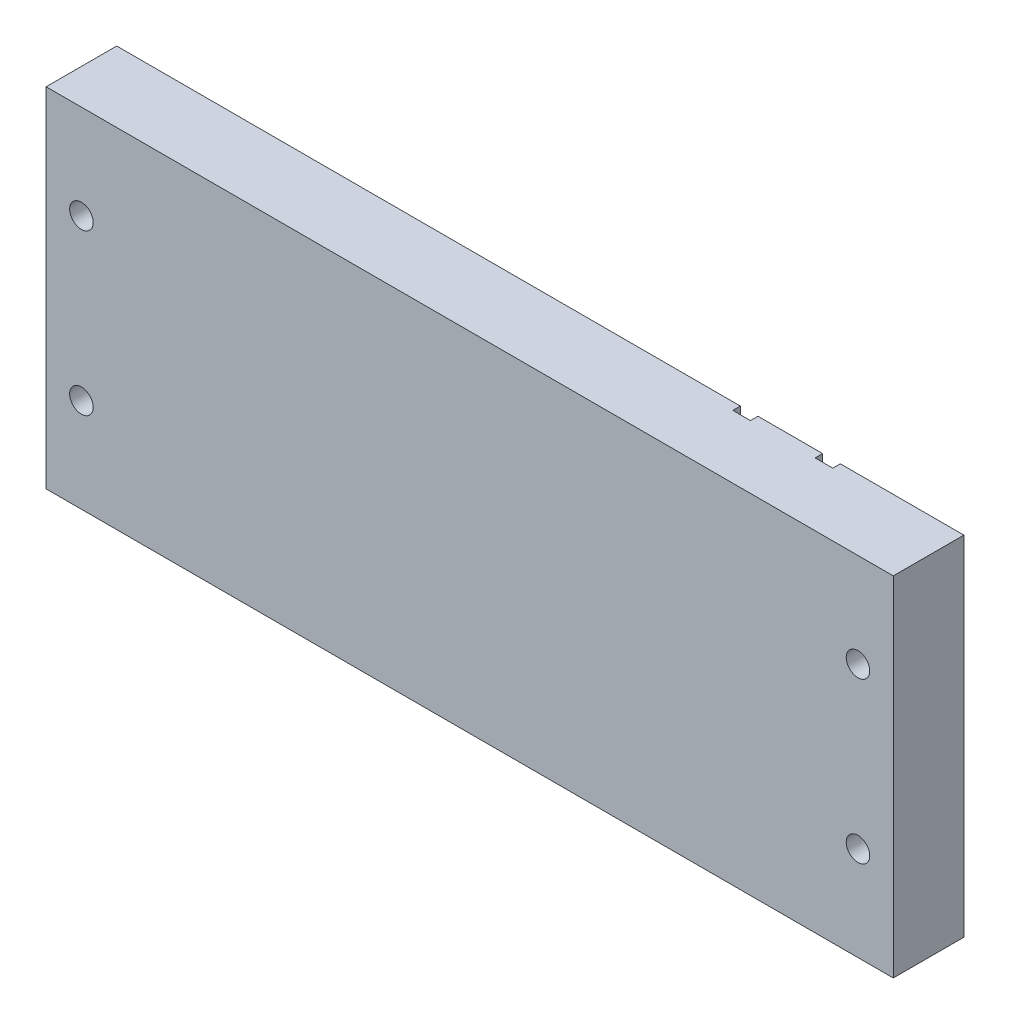
ISO-10303-21;
HEADER;
FILE_DESCRIPTION(('STEP AP214'),'2;1');
FILE_NAME('part.step','',(''),(''),'','','');
FILE_SCHEMA(('AUTOMOTIVE_DESIGN { 1 0 10303 214 1 1 1 1 }'));
ENDSEC;
DATA;
#1=APPLICATION_CONTEXT('core data for automotive mechanical design processes');
#2=APPLICATION_PROTOCOL_DEFINITION('international standard','automotive_design',2000,#1);
#3=PRODUCT_CONTEXT('',#1,'mechanical');
#4=PRODUCT('Part','Part','',(#3));
#5=PRODUCT_RELATED_PRODUCT_CATEGORY('part','',(#4));
#6=PRODUCT_DEFINITION_FORMATION('','',#4);
#7=PRODUCT_DEFINITION_CONTEXT('part definition',#1,'design');
#8=PRODUCT_DEFINITION('design','',#6,#7);
#9=PRODUCT_DEFINITION_SHAPE('','',#8);
#10=(LENGTH_UNIT() NAMED_UNIT(*) SI_UNIT(.MILLI.,.METRE.));
#11=(NAMED_UNIT(*) PLANE_ANGLE_UNIT() SI_UNIT($,.RADIAN.));
#12=(NAMED_UNIT(*) SI_UNIT($,.STERADIAN.) SOLID_ANGLE_UNIT());
#13=UNCERTAINTY_MEASURE_WITH_UNIT(LENGTH_MEASURE(1.E-05),#10,'distance_accuracy_value','');
#14=(GEOMETRIC_REPRESENTATION_CONTEXT(3) GLOBAL_UNCERTAINTY_ASSIGNED_CONTEXT((#13)) GLOBAL_UNIT_ASSIGNED_CONTEXT((#10,
#11,#12)) REPRESENTATION_CONTEXT('',''));
#15=CARTESIAN_POINT('',(0.,0.,0.));
#16=DIRECTION('',(0.,0.,1.));
#17=DIRECTION('',(1.,0.,0.));
#18=AXIS2_PLACEMENT_3D('',#15,#16,#17);
#19=CARTESIAN_POINT('',(-220.938462115417,46.9900000000002,0.));
#20=DIRECTION('',(0.,1.,0.));
#21=DIRECTION('',(0.,0.,1.));
#22=AXIS2_PLACEMENT_3D('',#19,#20,#21);
#23=PLANE('',#22);
#24=DIRECTION('',(0.,0.,1.));
#25=VECTOR('',#24,1.);
#26=CARTESIAN_POINT('',(-158.75,46.99,-9.525));
#27=LINE('',#26,#25);
#28=CARTESIAN_POINT('',(-158.75,46.99,-9.525));
#29=VERTEX_POINT('',#28);
#30=CARTESIAN_POINT('',(-158.75,46.99,9.525));
#31=VERTEX_POINT('',#30);
#32=EDGE_CURVE('E63',#29,#31,#27,.T.);
#33=ORIENTED_EDGE('',*,*,#32,.T.);
#34=DIRECTION('',(1.,0.,0.));
#35=VECTOR('',#34,1.);
#36=CARTESIAN_POINT('',(-158.75,46.99,9.52500000000001));
#37=LINE('',#36,#35);
#38=CARTESIAN_POINT('',(69.85,46.99,9.525));
#39=VERTEX_POINT('',#38);
#40=EDGE_CURVE('E42',#31,#39,#37,.T.);
#41=ORIENTED_EDGE('',*,*,#40,.T.);
#42=DIRECTION('',(0.,0.,-1.));
#43=VECTOR('',#42,1.);
#44=CARTESIAN_POINT('',(69.85,46.99,-9.525));
#45=LINE('',#44,#43);
#46=CARTESIAN_POINT('',(69.85,46.99,-9.525));
#47=VERTEX_POINT('',#46);
#48=EDGE_CURVE('E150',#39,#47,#45,.T.);
#49=ORIENTED_EDGE('',*,*,#48,.T.);
#50=DIRECTION('',(-1.,0.,0.));
#51=VECTOR('',#50,1.);
#52=CARTESIAN_POINT('',(69.85,46.99,-9.525));
#53=LINE('',#52,#51);
#54=CARTESIAN_POINT('',(36.5125,46.99,-9.525));
#55=VERTEX_POINT('',#54);
#56=EDGE_CURVE('E187',#47,#55,#53,.T.);
#57=ORIENTED_EDGE('',*,*,#56,.T.);
#58=DIRECTION('',(0.,0.,1.));
#59=VECTOR('',#58,1.);
#60=CARTESIAN_POINT('',(36.5125,46.99,-9.525));
#61=LINE('',#60,#59);
#62=CARTESIAN_POINT('',(36.5125,46.99,-7.49299999999999));
#63=VERTEX_POINT('',#62);
#64=EDGE_CURVE('E200',#55,#63,#61,.T.);
#65=ORIENTED_EDGE('',*,*,#64,.T.);
#66=DIRECTION('',(-1.,0.,0.));
#67=VECTOR('',#66,1.);
#68=CARTESIAN_POINT('',(36.5125,46.99,-7.49299999999999));
#69=LINE('',#68,#67);
#70=CARTESIAN_POINT('',(31.75,46.99,-7.49299999999999));
#71=VERTEX_POINT('',#70);
#72=EDGE_CURVE('E214',#63,#71,#69,.T.);
#73=ORIENTED_EDGE('',*,*,#72,.T.);
#74=DIRECTION('',(0.,0.,-1.));
#75=VECTOR('',#74,1.);
#76=CARTESIAN_POINT('',(31.75,46.99,-9.525));
#77=LINE('',#76,#75);
#78=CARTESIAN_POINT('',(31.75,46.99,-9.525));
#79=VERTEX_POINT('',#78);
#80=EDGE_CURVE('E228',#71,#79,#77,.T.);
#81=ORIENTED_EDGE('',*,*,#80,.T.);
#82=DIRECTION('',(-1.,0.,0.));
#83=VECTOR('',#82,1.);
#84=CARTESIAN_POINT('',(31.75,46.99,-9.525));
#85=LINE('',#84,#83);
#86=CARTESIAN_POINT('',(14.2875,46.99,-9.525));
#87=VERTEX_POINT('',#86);
#88=EDGE_CURVE('E242',#79,#87,#85,.T.);
#89=ORIENTED_EDGE('',*,*,#88,.T.);
#90=DIRECTION('',(0.,0.,1.));
#91=VECTOR('',#90,1.);
#92=CARTESIAN_POINT('',(14.2875,46.99,-9.525));
#93=LINE('',#92,#91);
#94=CARTESIAN_POINT('',(14.2875,46.99,-7.49299999999999));
#95=VERTEX_POINT('',#94);
#96=EDGE_CURVE('E256',#87,#95,#93,.T.);
#97=ORIENTED_EDGE('',*,*,#96,.T.);
#98=DIRECTION('',(-1.,0.,0.));
#99=VECTOR('',#98,1.);
#100=CARTESIAN_POINT('',(9.525,46.99,-7.49299999999999));
#101=LINE('',#100,#99);
#102=CARTESIAN_POINT('',(9.525,46.99,-7.49299999999999));
#103=VERTEX_POINT('',#102);
#104=EDGE_CURVE('E81',#95,#103,#101,.T.);
#105=ORIENTED_EDGE('',*,*,#104,.T.);
#106=DIRECTION('',(0.,0.,-1.));
#107=VECTOR('',#106,1.);
#108=CARTESIAN_POINT('',(9.525,46.99,-9.525));
#109=LINE('',#108,#107);
#110=CARTESIAN_POINT('',(9.525,46.99,-9.525));
#111=VERTEX_POINT('',#110);
#112=EDGE_CURVE('E75',#103,#111,#109,.T.);
#113=ORIENTED_EDGE('',*,*,#112,.T.);
#114=DIRECTION('',(-1.,0.,0.));
#115=VECTOR('',#114,1.);
#116=CARTESIAN_POINT('',(-158.75,46.99,-9.525));
#117=LINE('',#116,#115);
#118=EDGE_CURVE('E70',#111,#29,#117,.T.);
#119=ORIENTED_EDGE('',*,*,#118,.T.);
#120=EDGE_LOOP('',(#33,#41,#49,#57,#65,#73,#81,#89,#97,#105,#113,#119));
#121=FACE_BOUND('',#120,.T.);
#122=ADVANCED_FACE('F33',(#121),#23,.T.);
#123=CARTESIAN_POINT('',(-220.938462115417,-46.9899999999998,0.));
#124=DIRECTION('',(0.,1.,0.));
#125=DIRECTION('',(0.,0.,1.));
#126=AXIS2_PLACEMENT_3D('',#123,#124,#125);
#127=PLANE('',#126);
#128=DIRECTION('',(0.,0.,1.));
#129=VECTOR('',#128,1.);
#130=CARTESIAN_POINT('',(-158.75,-46.99,-9.525));
#131=LINE('',#130,#129);
#132=CARTESIAN_POINT('',(-158.75,-46.99,-9.525));
#133=VERTEX_POINT('',#132);
#134=CARTESIAN_POINT('',(-158.75,-46.99,9.525));
#135=VERTEX_POINT('',#134);
#136=EDGE_CURVE('E158',#133,#135,#131,.T.);
#137=ORIENTED_EDGE('',*,*,#136,.F.);
#138=DIRECTION('',(-1.,0.,0.));
#139=VECTOR('',#138,1.);
#140=CARTESIAN_POINT('',(-158.75,-46.99,-9.525));
#141=LINE('',#140,#139);
#142=CARTESIAN_POINT('',(9.525,-46.99,-9.525));
#143=VERTEX_POINT('',#142);
#144=EDGE_CURVE('E90',#143,#133,#141,.T.);
#145=ORIENTED_EDGE('',*,*,#144,.F.);
#146=DIRECTION('',(0.,0.,-1.));
#147=VECTOR('',#146,1.);
#148=CARTESIAN_POINT('',(9.525,-46.99,-9.525));
#149=LINE('',#148,#147);
#150=CARTESIAN_POINT('',(9.525,-46.99,-7.49299999999999));
#151=VERTEX_POINT('',#150);
#152=EDGE_CURVE('E95',#151,#143,#149,.T.);
#153=ORIENTED_EDGE('',*,*,#152,.F.);
#154=DIRECTION('',(-1.,0.,0.));
#155=VECTOR('',#154,1.);
#156=CARTESIAN_POINT('',(9.525,-46.99,-7.49299999999999));
#157=LINE('',#156,#155);
#158=CARTESIAN_POINT('',(14.2875,-46.99,-7.49299999999999));
#159=VERTEX_POINT('',#158);
#160=EDGE_CURVE('E101',#159,#151,#157,.T.);
#161=ORIENTED_EDGE('',*,*,#160,.F.);
#162=DIRECTION('',(0.,0.,1.));
#163=VECTOR('',#162,1.);
#164=CARTESIAN_POINT('',(14.2875,-46.99,-9.525));
#165=LINE('',#164,#163);
#166=CARTESIAN_POINT('',(14.2875,-46.99,-9.525));
#167=VERTEX_POINT('',#166);
#168=EDGE_CURVE('E250',#167,#159,#165,.T.);
#169=ORIENTED_EDGE('',*,*,#168,.F.);
#170=DIRECTION('',(-1.,0.,0.));
#171=VECTOR('',#170,1.);
#172=CARTESIAN_POINT('',(31.75,-46.99,-9.525));
#173=LINE('',#172,#171);
#174=CARTESIAN_POINT('',(31.75,-46.99,-9.525));
#175=VERTEX_POINT('',#174);
#176=EDGE_CURVE('E236',#175,#167,#173,.T.);
#177=ORIENTED_EDGE('',*,*,#176,.F.);
#178=DIRECTION('',(0.,0.,-1.));
#179=VECTOR('',#178,1.);
#180=CARTESIAN_POINT('',(31.75,-46.99,-9.525));
#181=LINE('',#180,#179);
#182=CARTESIAN_POINT('',(31.75,-46.99,-7.49299999999999));
#183=VERTEX_POINT('',#182);
#184=EDGE_CURVE('E222',#183,#175,#181,.T.);
#185=ORIENTED_EDGE('',*,*,#184,.F.);
#186=DIRECTION('',(-1.,0.,0.));
#187=VECTOR('',#186,1.);
#188=CARTESIAN_POINT('',(36.5125,-46.99,-7.49299999999999));
#189=LINE('',#188,#187);
#190=CARTESIAN_POINT('',(36.5125,-46.99,-7.49299999999999));
#191=VERTEX_POINT('',#190);
#192=EDGE_CURVE('E208',#191,#183,#189,.T.);
#193=ORIENTED_EDGE('',*,*,#192,.F.);
#194=DIRECTION('',(0.,0.,1.));
#195=VECTOR('',#194,1.);
#196=CARTESIAN_POINT('',(36.5125,-46.99,-9.525));
#197=LINE('',#196,#195);
#198=CARTESIAN_POINT('',(36.5125,-46.99,-9.525));
#199=VERTEX_POINT('',#198);
#200=EDGE_CURVE('E194',#199,#191,#197,.T.);
#201=ORIENTED_EDGE('',*,*,#200,.F.);
#202=DIRECTION('',(-1.,0.,0.));
#203=VECTOR('',#202,1.);
#204=CARTESIAN_POINT('',(69.85,-46.99,-9.525));
#205=LINE('',#204,#203);
#206=CARTESIAN_POINT('',(69.85,-46.99,-9.525));
#207=VERTEX_POINT('',#206);
#208=EDGE_CURVE('E141',#207,#199,#205,.T.);
#209=ORIENTED_EDGE('',*,*,#208,.F.);
#210=DIRECTION('',(0.,0.,-1.));
#211=VECTOR('',#210,1.);
#212=CARTESIAN_POINT('',(69.85,-46.99,-9.525));
#213=LINE('',#212,#211);
#214=CARTESIAN_POINT('',(69.85,-46.99,9.525));
#215=VERTEX_POINT('',#214);
#216=EDGE_CURVE('E137',#215,#207,#213,.T.);
#217=ORIENTED_EDGE('',*,*,#216,.F.);
#218=DIRECTION('',(1.,0.,0.));
#219=VECTOR('',#218,1.);
#220=CARTESIAN_POINT('',(-158.75,-46.99,9.52500000000001));
#221=LINE('',#220,#219);
#222=EDGE_CURVE('E12',#135,#215,#221,.T.);
#223=ORIENTED_EDGE('',*,*,#222,.F.);
#224=EDGE_LOOP('',(#137,#145,#153,#161,#169,#177,#185,#193,#201,#209,#217,#223));
#225=FACE_BOUND('',#224,.T.);
#226=ADVANCED_FACE('F139',(#225),#127,.F.);
#227=CARTESIAN_POINT('',(-158.75,-46.99,-9.525));
#228=DIRECTION('',(-1.,0.,0.));
#229=DIRECTION('',(0.,0.,1.));
#230=AXIS2_PLACEMENT_3D('',#227,#228,#229);
#231=PLANE('',#230);
#232=ORIENTED_EDGE('',*,*,#32,.F.);
#233=DIRECTION('',(0.,1.,0.));
#234=VECTOR('',#233,1.);
#235=CARTESIAN_POINT('',(-158.75,-46.99,-9.525));
#236=LINE('',#235,#234);
#237=EDGE_CURVE('E162',#133,#29,#236,.T.);
#238=ORIENTED_EDGE('',*,*,#237,.F.);
#239=ORIENTED_EDGE('',*,*,#136,.T.);
#240=DIRECTION('',(0.,1.,0.));
#241=VECTOR('',#240,1.);
#242=CARTESIAN_POINT('',(-158.75,-46.99,9.52500000000001));
#243=LINE('',#242,#241);
#244=EDGE_CURVE('E155',#135,#31,#243,.T.);
#245=ORIENTED_EDGE('',*,*,#244,.T.);
#246=EDGE_LOOP('',(#232,#238,#239,#245));
#247=FACE_BOUND('',#246,.T.);
#248=ADVANCED_FACE('F161',(#247),#231,.T.);
#249=CARTESIAN_POINT('',(-158.75,-46.99,-9.525));
#250=DIRECTION('',(0.,0.,-1.));
#251=DIRECTION('',(-1.,0.,0.));
#252=AXIS2_PLACEMENT_3D('',#249,#250,#251);
#253=PLANE('',#252);
#254=CARTESIAN_POINT('',(-149.225,21.59,-9.525));
#255=DIRECTION('',(0.,0.,-1.));
#256=DIRECTION('',(-1.,0.,0.));
#257=AXIS2_PLACEMENT_3D('',#254,#255,#256);
#258=CIRCLE('',#257,3.17499999999998);
#259=CARTESIAN_POINT('',(-152.4,21.59,-9.525));
#260=VERTEX_POINT('',#259);
#261=EDGE_CURVE('E393',#260,#260,#258,.T.);
#262=ORIENTED_EDGE('',*,*,#261,.F.);
#263=EDGE_LOOP('',(#262));
#264=FACE_BOUND('',#263,.T.);
#265=CARTESIAN_POINT('',(-149.225,-21.59,-9.525));
#266=DIRECTION('',(0.,0.,-1.));
#267=DIRECTION('',(-1.,0.,0.));
#268=AXIS2_PLACEMENT_3D('',#265,#266,#267);
#269=CIRCLE('',#268,3.17499999999998);
#270=CARTESIAN_POINT('',(-152.4,-21.59,-9.525));
#271=VERTEX_POINT('',#270);
#272=EDGE_CURVE('E399',#271,#271,#269,.T.);
#273=ORIENTED_EDGE('',*,*,#272,.F.);
#274=EDGE_LOOP('',(#273));
#275=FACE_BOUND('',#274,.T.);
#276=ORIENTED_EDGE('',*,*,#118,.F.);
#277=DIRECTION('',(0.,1.,0.));
#278=VECTOR('',#277,1.);
#279=CARTESIAN_POINT('',(9.525,-46.99,-9.525));
#280=LINE('',#279,#278);
#281=EDGE_CURVE('E287',#143,#111,#280,.T.);
#282=ORIENTED_EDGE('',*,*,#281,.F.);
#283=ORIENTED_EDGE('',*,*,#144,.T.);
#284=ORIENTED_EDGE('',*,*,#237,.T.);
#285=EDGE_LOOP('',(#276,#282,#283,#284));
#286=FACE_BOUND('',#285,.T.);
#287=ADVANCED_FACE('F297',(#264,#275,#286),#253,.T.);
#288=CARTESIAN_POINT('',(9.525,-46.99,-9.525));
#289=DIRECTION('',(1.,0.,0.));
#290=DIRECTION('',(0.,0.,-1.));
#291=AXIS2_PLACEMENT_3D('',#288,#289,#290);
#292=PLANE('',#291);
#293=ORIENTED_EDGE('',*,*,#112,.F.);
#294=DIRECTION('',(0.,1.,0.));
#295=VECTOR('',#294,1.);
#296=CARTESIAN_POINT('',(9.525,-46.99,-7.49299999999999));
#297=LINE('',#296,#295);
#298=EDGE_CURVE('E277',#151,#103,#297,.T.);
#299=ORIENTED_EDGE('',*,*,#298,.F.);
#300=ORIENTED_EDGE('',*,*,#152,.T.);
#301=ORIENTED_EDGE('',*,*,#281,.T.);
#302=EDGE_LOOP('',(#293,#299,#300,#301));
#303=FACE_BOUND('',#302,.T.);
#304=ADVANCED_FACE('F299',(#303),#292,.T.);
#305=CARTESIAN_POINT('',(9.525,-46.99,-7.49299999999999));
#306=DIRECTION('',(0.,0.,-1.));
#307=DIRECTION('',(-1.,0.,0.));
#308=AXIS2_PLACEMENT_3D('',#305,#306,#307);
#309=PLANE('',#308);
#310=ORIENTED_EDGE('',*,*,#104,.F.);
#311=DIRECTION('',(0.,1.,0.));
#312=VECTOR('',#311,1.);
#313=CARTESIAN_POINT('',(14.2875,-46.99,-7.49299999999999));
#314=LINE('',#313,#312);
#315=EDGE_CURVE('E266',#159,#95,#314,.T.);
#316=ORIENTED_EDGE('',*,*,#315,.F.);
#317=ORIENTED_EDGE('',*,*,#160,.T.);
#318=ORIENTED_EDGE('',*,*,#298,.T.);
#319=EDGE_LOOP('',(#310,#316,#317,#318));
#320=FACE_BOUND('',#319,.T.);
#321=ADVANCED_FACE('F301',(#320),#309,.T.);
#322=CARTESIAN_POINT('',(14.2875,-46.99,-9.525));
#323=DIRECTION('',(-1.,0.,0.));
#324=DIRECTION('',(0.,0.,1.));
#325=AXIS2_PLACEMENT_3D('',#322,#323,#324);
#326=PLANE('',#325);
#327=ORIENTED_EDGE('',*,*,#96,.F.);
#328=DIRECTION('',(0.,1.,0.));
#329=VECTOR('',#328,1.);
#330=CARTESIAN_POINT('',(14.2875,-46.99,-9.525));
#331=LINE('',#330,#329);
#332=EDGE_CURVE('E253',#167,#87,#331,.T.);
#333=ORIENTED_EDGE('',*,*,#332,.F.);
#334=ORIENTED_EDGE('',*,*,#168,.T.);
#335=ORIENTED_EDGE('',*,*,#315,.T.);
#336=EDGE_LOOP('',(#327,#333,#334,#335));
#337=FACE_BOUND('',#336,.T.);
#338=ADVANCED_FACE('F305',(#337),#326,.T.);
#339=CARTESIAN_POINT('',(31.75,-46.99,-9.525));
#340=DIRECTION('',(0.,0.,-1.));
#341=DIRECTION('',(-1.,0.,0.));
#342=AXIS2_PLACEMENT_3D('',#339,#340,#341);
#343=PLANE('',#342);
#344=ORIENTED_EDGE('',*,*,#88,.F.);
#345=DIRECTION('',(0.,1.,0.));
#346=VECTOR('',#345,1.);
#347=CARTESIAN_POINT('',(31.75,-46.99,-9.525));
#348=LINE('',#347,#346);
#349=EDGE_CURVE('E239',#175,#79,#348,.T.);
#350=ORIENTED_EDGE('',*,*,#349,.F.);
#351=ORIENTED_EDGE('',*,*,#176,.T.);
#352=ORIENTED_EDGE('',*,*,#332,.T.);
#353=EDGE_LOOP('',(#344,#350,#351,#352));
#354=FACE_BOUND('',#353,.T.);
#355=ADVANCED_FACE('F310',(#354),#343,.T.);
#356=CARTESIAN_POINT('',(31.75,-46.99,-9.525));
#357=DIRECTION('',(1.,0.,0.));
#358=DIRECTION('',(0.,0.,-1.));
#359=AXIS2_PLACEMENT_3D('',#356,#357,#358);
#360=PLANE('',#359);
#361=ORIENTED_EDGE('',*,*,#80,.F.);
#362=DIRECTION('',(0.,1.,0.));
#363=VECTOR('',#362,1.);
#364=CARTESIAN_POINT('',(31.75,-46.99,-7.49299999999999));
#365=LINE('',#364,#363);
#366=EDGE_CURVE('E225',#183,#71,#365,.T.);
#367=ORIENTED_EDGE('',*,*,#366,.F.);
#368=ORIENTED_EDGE('',*,*,#184,.T.);
#369=ORIENTED_EDGE('',*,*,#349,.T.);
#370=EDGE_LOOP('',(#361,#367,#368,#369));
#371=FACE_BOUND('',#370,.T.);
#372=ADVANCED_FACE('F313',(#371),#360,.T.);
#373=CARTESIAN_POINT('',(36.5125,-46.99,-7.49299999999999));
#374=DIRECTION('',(0.,0.,-1.));
#375=DIRECTION('',(-1.,0.,0.));
#376=AXIS2_PLACEMENT_3D('',#373,#374,#375);
#377=PLANE('',#376);
#378=ORIENTED_EDGE('',*,*,#72,.F.);
#379=DIRECTION('',(0.,1.,0.));
#380=VECTOR('',#379,1.);
#381=CARTESIAN_POINT('',(36.5125,-46.99,-7.49299999999999));
#382=LINE('',#381,#380);
#383=EDGE_CURVE('E211',#191,#63,#382,.T.);
#384=ORIENTED_EDGE('',*,*,#383,.F.);
#385=ORIENTED_EDGE('',*,*,#192,.T.);
#386=ORIENTED_EDGE('',*,*,#366,.T.);
#387=EDGE_LOOP('',(#378,#384,#385,#386));
#388=FACE_BOUND('',#387,.T.);
#389=ADVANCED_FACE('F317',(#388),#377,.T.);
#390=CARTESIAN_POINT('',(36.5125,-46.99,-9.525));
#391=DIRECTION('',(-1.,0.,0.));
#392=DIRECTION('',(0.,0.,1.));
#393=AXIS2_PLACEMENT_3D('',#390,#391,#392);
#394=PLANE('',#393);
#395=ORIENTED_EDGE('',*,*,#64,.F.);
#396=DIRECTION('',(0.,1.,0.));
#397=VECTOR('',#396,1.);
#398=CARTESIAN_POINT('',(36.5125,-46.99,-9.525));
#399=LINE('',#398,#397);
#400=EDGE_CURVE('E197',#199,#55,#399,.T.);
#401=ORIENTED_EDGE('',*,*,#400,.F.);
#402=ORIENTED_EDGE('',*,*,#200,.T.);
#403=ORIENTED_EDGE('',*,*,#383,.T.);
#404=EDGE_LOOP('',(#395,#401,#402,#403));
#405=FACE_BOUND('',#404,.T.);
#406=ADVANCED_FACE('F321',(#405),#394,.T.);
#407=CARTESIAN_POINT('',(69.85,-46.99,-9.525));
#408=DIRECTION('',(0.,0.,-1.));
#409=DIRECTION('',(-1.,0.,0.));
#410=AXIS2_PLACEMENT_3D('',#407,#408,#409);
#411=PLANE('',#410);
#412=CARTESIAN_POINT('',(60.325,21.59,-9.525));
#413=DIRECTION('',(0.,0.,-1.));
#414=DIRECTION('',(-1.,0.,0.));
#415=AXIS2_PLACEMENT_3D('',#412,#413,#414);
#416=CIRCLE('',#415,3.17499999999999);
#417=CARTESIAN_POINT('',(57.15,21.59,-9.525));
#418=VERTEX_POINT('',#417);
#419=EDGE_CURVE('E383',#418,#418,#416,.T.);
#420=ORIENTED_EDGE('',*,*,#419,.F.);
#421=EDGE_LOOP('',(#420));
#422=FACE_BOUND('',#421,.T.);
#423=CARTESIAN_POINT('',(60.325,-21.59,-9.525));
#424=DIRECTION('',(0.,0.,-1.));
#425=DIRECTION('',(-1.,0.,0.));
#426=AXIS2_PLACEMENT_3D('',#423,#424,#425);
#427=CIRCLE('',#426,3.17499999999999);
#428=CARTESIAN_POINT('',(57.15,-21.59,-9.525));
#429=VERTEX_POINT('',#428);
#430=EDGE_CURVE('E385',#429,#429,#427,.T.);
#431=ORIENTED_EDGE('',*,*,#430,.F.);
#432=EDGE_LOOP('',(#431));
#433=FACE_BOUND('',#432,.T.);
#434=ORIENTED_EDGE('',*,*,#56,.F.);
#435=DIRECTION('',(0.,1.,0.));
#436=VECTOR('',#435,1.);
#437=CARTESIAN_POINT('',(69.85,-46.99,-9.525));
#438=LINE('',#437,#436);
#439=EDGE_CURVE('E185',#207,#47,#438,.T.);
#440=ORIENTED_EDGE('',*,*,#439,.F.);
#441=ORIENTED_EDGE('',*,*,#208,.T.);
#442=ORIENTED_EDGE('',*,*,#400,.T.);
#443=EDGE_LOOP('',(#434,#440,#441,#442));
#444=FACE_BOUND('',#443,.T.);
#445=ADVANCED_FACE('F324',(#422,#433,#444),#411,.T.);
#446=CARTESIAN_POINT('',(69.85,-46.99,-9.525));
#447=DIRECTION('',(1.,0.,0.));
#448=DIRECTION('',(0.,0.,-1.));
#449=AXIS2_PLACEMENT_3D('',#446,#447,#448);
#450=PLANE('',#449);
#451=ORIENTED_EDGE('',*,*,#48,.F.);
#452=DIRECTION('',(0.,1.,0.));
#453=VECTOR('',#452,1.);
#454=CARTESIAN_POINT('',(69.85,-46.99,9.52500000000001));
#455=LINE('',#454,#453);
#456=EDGE_CURVE('E145',#215,#39,#455,.T.);
#457=ORIENTED_EDGE('',*,*,#456,.F.);
#458=ORIENTED_EDGE('',*,*,#216,.T.);
#459=ORIENTED_EDGE('',*,*,#439,.T.);
#460=EDGE_LOOP('',(#451,#457,#458,#459));
#461=FACE_BOUND('',#460,.T.);
#462=ADVANCED_FACE('F149',(#461),#450,.T.);
#463=CARTESIAN_POINT('',(-158.75,-46.99,9.52500000000001));
#464=DIRECTION('',(0.,0.,1.));
#465=DIRECTION('',(1.,0.,0.));
#466=AXIS2_PLACEMENT_3D('',#463,#464,#465);
#467=PLANE('',#466);
#468=CARTESIAN_POINT('',(60.325,21.59,9.525));
#469=DIRECTION('',(0.,0.,-1.));
#470=DIRECTION('',(-1.,0.,0.));
#471=AXIS2_PLACEMENT_3D('',#468,#469,#470);
#472=CIRCLE('',#471,3.17499999999999);
#473=CARTESIAN_POINT('',(57.15,21.59,9.525));
#474=VERTEX_POINT('',#473);
#475=EDGE_CURVE('E380',#474,#474,#472,.T.);
#476=ORIENTED_EDGE('',*,*,#475,.T.);
#477=EDGE_LOOP('',(#476));
#478=FACE_BOUND('',#477,.T.);
#479=CARTESIAN_POINT('',(60.325,-21.59,9.525));
#480=DIRECTION('',(0.,0.,-1.));
#481=DIRECTION('',(-1.,0.,0.));
#482=AXIS2_PLACEMENT_3D('',#479,#480,#481);
#483=CIRCLE('',#482,3.17499999999999);
#484=CARTESIAN_POINT('',(57.15,-21.59,9.525));
#485=VERTEX_POINT('',#484);
#486=EDGE_CURVE('E390',#485,#485,#483,.T.);
#487=ORIENTED_EDGE('',*,*,#486,.T.);
#488=EDGE_LOOP('',(#487));
#489=FACE_BOUND('',#488,.T.);
#490=CARTESIAN_POINT('',(-149.225,21.59,9.525));
#491=DIRECTION('',(0.,0.,-1.));
#492=DIRECTION('',(-1.,0.,0.));
#493=AXIS2_PLACEMENT_3D('',#490,#491,#492);
#494=CIRCLE('',#493,3.17499999999998);
#495=CARTESIAN_POINT('',(-152.4,21.59,9.525));
#496=VERTEX_POINT('',#495);
#497=EDGE_CURVE('E396',#496,#496,#494,.T.);
#498=ORIENTED_EDGE('',*,*,#497,.T.);
#499=EDGE_LOOP('',(#498));
#500=FACE_BOUND('',#499,.T.);
#501=CARTESIAN_POINT('',(-149.225,-21.59,9.525));
#502=DIRECTION('',(0.,0.,-1.));
#503=DIRECTION('',(-1.,0.,0.));
#504=AXIS2_PLACEMENT_3D('',#501,#502,#503);
#505=CIRCLE('',#504,3.17499999999998);
#506=CARTESIAN_POINT('',(-152.4,-21.59,9.525));
#507=VERTEX_POINT('',#506);
#508=EDGE_CURVE('E176',#507,#507,#505,.T.);
#509=ORIENTED_EDGE('',*,*,#508,.T.);
#510=EDGE_LOOP('',(#509));
#511=FACE_BOUND('',#510,.T.);
#512=ORIENTED_EDGE('',*,*,#40,.F.);
#513=ORIENTED_EDGE('',*,*,#244,.F.);
#514=ORIENTED_EDGE('',*,*,#222,.T.);
#515=ORIENTED_EDGE('',*,*,#456,.T.);
#516=EDGE_LOOP('',(#512,#513,#514,#515));
#517=FACE_BOUND('',#516,.T.);
#518=ADVANCED_FACE('F154',(#478,#489,#500,#511,#517),#467,.T.);
#519=CARTESIAN_POINT('',(-149.225,-21.59,-9.525));
#520=DIRECTION('',(0.,0.,-1.));
#521=DIRECTION('',(-1.,0.,0.));
#522=AXIS2_PLACEMENT_3D('',#519,#520,#521);
#523=CYLINDRICAL_SURFACE('',#522,3.17499999999998);
#524=ORIENTED_EDGE('',*,*,#508,.F.);
#525=EDGE_LOOP('',(#524));
#526=FACE_BOUND('',#525,.T.);
#527=ORIENTED_EDGE('',*,*,#272,.T.);
#528=EDGE_LOOP('',(#527));
#529=FACE_BOUND('',#528,.T.);
#530=ADVANCED_FACE('F326',(#526,#529),#523,.F.);
#531=CARTESIAN_POINT('',(-149.225,21.59,-9.525));
#532=DIRECTION('',(0.,0.,-1.));
#533=DIRECTION('',(-1.,0.,0.));
#534=AXIS2_PLACEMENT_3D('',#531,#532,#533);
#535=CYLINDRICAL_SURFACE('',#534,3.17499999999998);
#536=ORIENTED_EDGE('',*,*,#497,.F.);
#537=EDGE_LOOP('',(#536));
#538=FACE_BOUND('',#537,.T.);
#539=ORIENTED_EDGE('',*,*,#261,.T.);
#540=EDGE_LOOP('',(#539));
#541=FACE_BOUND('',#540,.T.);
#542=ADVANCED_FACE('F331',(#538,#541),#535,.F.);
#543=CARTESIAN_POINT('',(60.325,-21.59,-9.525));
#544=DIRECTION('',(0.,0.,-1.));
#545=DIRECTION('',(-1.,0.,0.));
#546=AXIS2_PLACEMENT_3D('',#543,#544,#545);
#547=CYLINDRICAL_SURFACE('',#546,3.17499999999999);
#548=ORIENTED_EDGE('',*,*,#486,.F.);
#549=EDGE_LOOP('',(#548));
#550=FACE_BOUND('',#549,.T.);
#551=ORIENTED_EDGE('',*,*,#430,.T.);
#552=EDGE_LOOP('',(#551));
#553=FACE_BOUND('',#552,.T.);
#554=ADVANCED_FACE('F368',(#550,#553),#547,.F.);
#555=CARTESIAN_POINT('',(60.325,21.59,-9.525));
#556=DIRECTION('',(0.,0.,-1.));
#557=DIRECTION('',(-1.,0.,0.));
#558=AXIS2_PLACEMENT_3D('',#555,#556,#557);
#559=CYLINDRICAL_SURFACE('',#558,3.17499999999999);
#560=ORIENTED_EDGE('',*,*,#475,.F.);
#561=EDGE_LOOP('',(#560));
#562=FACE_BOUND('',#561,.T.);
#563=ORIENTED_EDGE('',*,*,#419,.T.);
#564=EDGE_LOOP('',(#563));
#565=FACE_BOUND('',#564,.T.);
#566=ADVANCED_FACE('F372',(#562,#565),#559,.F.);
#567=CLOSED_SHELL('',(#122,#226,#248,#287,#304,#321,#338,#355,#372,#389,#406,#445,#462,#518,
#530,#542,#554,#566));
#568=MANIFOLD_SOLID_BREP('B2',#567);
#569=ADVANCED_BREP_SHAPE_REPRESENTATION('',(#18,#568),#14);
#570=SHAPE_DEFINITION_REPRESENTATION(#9,#569);
ENDSEC;
END-ISO-10303-21;
